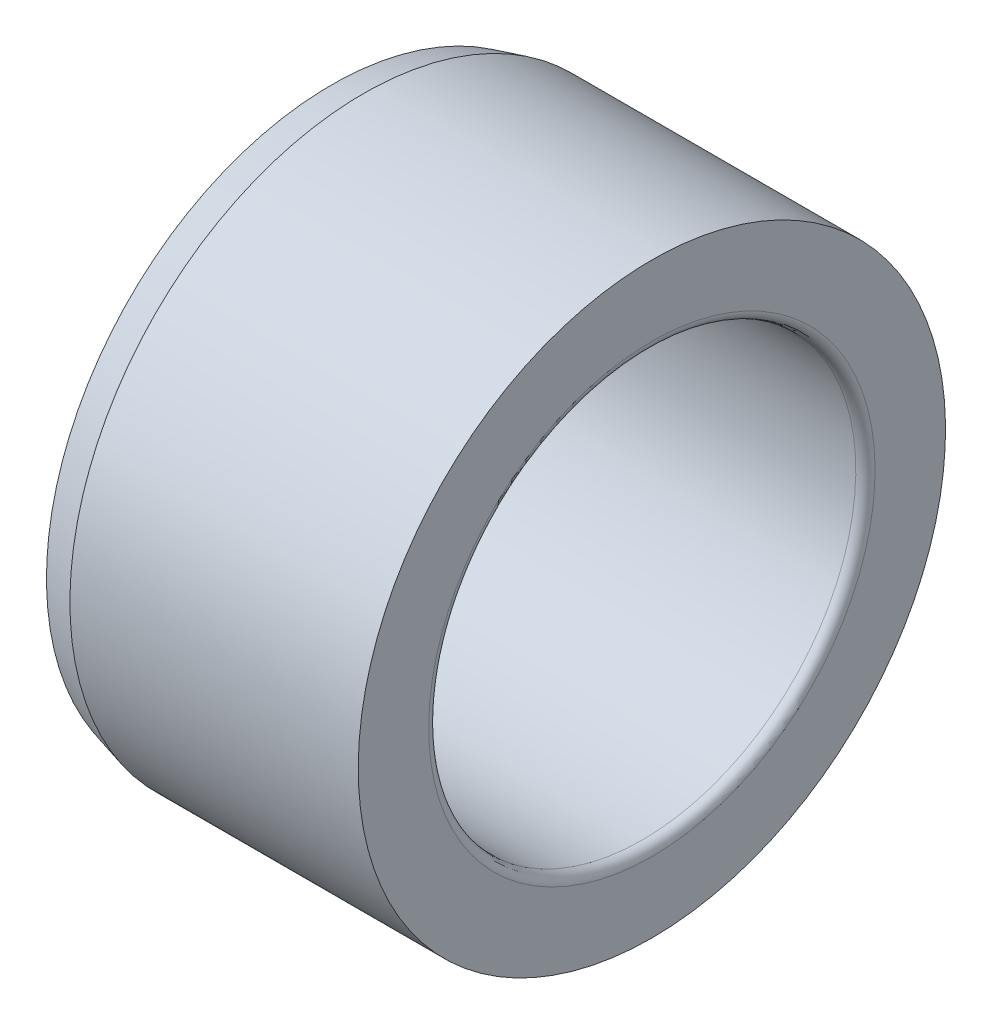
ISO-10303-21;
HEADER;
FILE_DESCRIPTION(('STEP AP214'),'2;1');
FILE_NAME('part.step','',(''),(''),'','','');
FILE_SCHEMA(('AUTOMOTIVE_DESIGN { 1 0 10303 214 1 1 1 1 }'));
ENDSEC;
DATA;
#1=APPLICATION_CONTEXT('core data for automotive mechanical design processes');
#2=APPLICATION_PROTOCOL_DEFINITION('international standard','automotive_design',2000,#1);
#3=PRODUCT_CONTEXT('',#1,'mechanical');
#4=PRODUCT('Part','Part','',(#3));
#5=PRODUCT_RELATED_PRODUCT_CATEGORY('part','',(#4));
#6=PRODUCT_DEFINITION_FORMATION('','',#4);
#7=PRODUCT_DEFINITION_CONTEXT('part definition',#1,'design');
#8=PRODUCT_DEFINITION('design','',#6,#7);
#9=PRODUCT_DEFINITION_SHAPE('','',#8);
#10=(LENGTH_UNIT() NAMED_UNIT(*) SI_UNIT(.MILLI.,.METRE.));
#11=(NAMED_UNIT(*) PLANE_ANGLE_UNIT() SI_UNIT($,.RADIAN.));
#12=(NAMED_UNIT(*) SI_UNIT($,.STERADIAN.) SOLID_ANGLE_UNIT());
#13=UNCERTAINTY_MEASURE_WITH_UNIT(LENGTH_MEASURE(1.E-05),#10,'distance_accuracy_value','');
#14=(GEOMETRIC_REPRESENTATION_CONTEXT(3) GLOBAL_UNCERTAINTY_ASSIGNED_CONTEXT((#13)) GLOBAL_UNIT_ASSIGNED_CONTEXT((#10,
#11,#12)) REPRESENTATION_CONTEXT('',''));
#15=CARTESIAN_POINT('',(0.,0.,0.));
#16=DIRECTION('',(0.,0.,1.));
#17=DIRECTION('',(1.,0.,0.));
#18=AXIS2_PLACEMENT_3D('',#15,#16,#17);
#19=CARTESIAN_POINT('',(8.9535,0.,0.));
#20=DIRECTION('',(-1.,0.,0.));
#21=DIRECTION('',(0.,-1.,0.));
#22=AXIS2_PLACEMENT_3D('',#19,#20,#21);
#23=TOROIDAL_SURFACE('',#22,13.2715,0.571499999999998);
#24=CARTESIAN_POINT('',(9.52500000000001,0.,0.));
#25=DIRECTION('',(-1.,0.,0.));
#26=DIRECTION('',(0.,-1.,0.));
#27=AXIS2_PLACEMENT_3D('',#24,#25,#26);
#28=CIRCLE('',#27,13.2715);
#29=CARTESIAN_POINT('',(9.52500000000001,-13.2715,0.));
#30=VERTEX_POINT('',#29);
#31=EDGE_CURVE('E10',#30,#30,#28,.T.);
#32=ORIENTED_EDGE('',*,*,#31,.F.);
#33=EDGE_LOOP('',(#32));
#34=FACE_BOUND('',#33,.T.);
#35=CARTESIAN_POINT('',(8.9535,0.,0.));
#36=DIRECTION('',(-1.,0.,0.));
#37=DIRECTION('',(0.,-1.,0.));
#38=AXIS2_PLACEMENT_3D('',#35,#36,#37);
#39=CIRCLE('',#38,12.7);
#40=CARTESIAN_POINT('',(8.95350000000001,-12.7,0.));
#41=VERTEX_POINT('',#40);
#42=EDGE_CURVE('E55',#41,#41,#39,.T.);
#43=ORIENTED_EDGE('',*,*,#42,.T.);
#44=EDGE_LOOP('',(#43));
#45=FACE_BOUND('',#44,.T.);
#46=ADVANCED_FACE('F33',(#34,#45),#23,.T.);
#47=CARTESIAN_POINT('',(9.52500000000001,17.4625,0.));
#48=DIRECTION('',(-1.,0.,0.));
#49=DIRECTION('',(0.,-1.,0.));
#50=AXIS2_PLACEMENT_3D('',#47,#48,#49);
#51=PLANE('',#50);
#52=CARTESIAN_POINT('',(9.52500000000001,0.,0.));
#53=DIRECTION('',(-1.,0.,0.));
#54=DIRECTION('',(0.,-1.,0.));
#55=AXIS2_PLACEMENT_3D('',#52,#53,#54);
#56=CIRCLE('',#55,17.4625);
#57=CARTESIAN_POINT('',(9.52500000000001,-17.4625,0.));
#58=VERTEX_POINT('',#57);
#59=EDGE_CURVE('E39',#58,#58,#56,.T.);
#60=ORIENTED_EDGE('',*,*,#59,.F.);
#61=EDGE_LOOP('',(#60));
#62=FACE_BOUND('',#61,.T.);
#63=ORIENTED_EDGE('',*,*,#31,.T.);
#64=EDGE_LOOP('',(#63));
#65=FACE_BOUND('',#64,.T.);
#66=ADVANCED_FACE('F80',(#62,#65),#51,.F.);
#67=CARTESIAN_POINT('',(-9.52500000000001,0.,0.));
#68=DIRECTION('',(-1.,0.,0.));
#69=DIRECTION('',(0.,-1.,0.));
#70=AXIS2_PLACEMENT_3D('',#67,#68,#69);
#71=CYLINDRICAL_SURFACE('',#70,17.4625);
#72=CARTESIAN_POINT('',(-7.62000000000002,0.,0.));
#73=DIRECTION('',(-1.,0.,0.));
#74=DIRECTION('',(0.,-1.,0.));
#75=AXIS2_PLACEMENT_3D('',#72,#73,#74);
#76=CIRCLE('',#75,17.4625);
#77=CARTESIAN_POINT('',(-7.62000000000001,-17.4625,0.));
#78=VERTEX_POINT('',#77);
#79=EDGE_CURVE('E43',#78,#78,#76,.T.);
#80=ORIENTED_EDGE('',*,*,#79,.F.);
#81=EDGE_LOOP('',(#80));
#82=FACE_BOUND('',#81,.T.);
#83=ORIENTED_EDGE('',*,*,#59,.T.);
#84=EDGE_LOOP('',(#83));
#85=FACE_BOUND('',#84,.T.);
#86=ADVANCED_FACE('F75',(#82,#85),#71,.T.);
#87=CARTESIAN_POINT('',(-7.62000000000002,0.,0.));
#88=DIRECTION('',(1.,0.,0.));
#89=DIRECTION('',(0.,1.,0.));
#90=AXIS2_PLACEMENT_3D('',#87,#88,#89);
#91=CONICAL_SURFACE('',#90,17.4625,0.261799387799152);
#92=CARTESIAN_POINT('',(-9.52500000000001,0.,0.));
#93=DIRECTION('',(-1.,0.,0.));
#94=DIRECTION('',(0.,-1.,0.));
#95=AXIS2_PLACEMENT_3D('',#92,#93,#94);
#96=CIRCLE('',#95,16.9520567884187);
#97=CARTESIAN_POINT('',(-9.525,-16.9520567884187,0.));
#98=VERTEX_POINT('',#97);
#99=EDGE_CURVE('E47',#98,#98,#96,.T.);
#100=ORIENTED_EDGE('',*,*,#99,.F.);
#101=EDGE_LOOP('',(#100));
#102=FACE_BOUND('',#101,.T.);
#103=ORIENTED_EDGE('',*,*,#79,.T.);
#104=EDGE_LOOP('',(#103));
#105=FACE_BOUND('',#104,.T.);
#106=ADVANCED_FACE('F69',(#102,#105),#91,.T.);
#107=CARTESIAN_POINT('',(-9.52500000000001,16.9520567884187,0.));
#108=DIRECTION('',(1.,0.,0.));
#109=DIRECTION('',(0.,1.,0.));
#110=AXIS2_PLACEMENT_3D('',#107,#108,#109);
#111=PLANE('',#110);
#112=CARTESIAN_POINT('',(-9.52500000000001,0.,0.));
#113=DIRECTION('',(-1.,0.,0.));
#114=DIRECTION('',(0.,-1.,0.));
#115=AXIS2_PLACEMENT_3D('',#112,#113,#114);
#116=CIRCLE('',#115,12.7);
#117=CARTESIAN_POINT('',(-9.525,-12.7,0.));
#118=VERTEX_POINT('',#117);
#119=EDGE_CURVE('E52',#118,#118,#116,.T.);
#120=ORIENTED_EDGE('',*,*,#119,.F.);
#121=EDGE_LOOP('',(#120));
#122=FACE_BOUND('',#121,.T.);
#123=ORIENTED_EDGE('',*,*,#99,.T.);
#124=EDGE_LOOP('',(#123));
#125=FACE_BOUND('',#124,.T.);
#126=ADVANCED_FACE('F63',(#122,#125),#111,.F.);
#127=CARTESIAN_POINT('',(-9.52500000000001,0.,0.));
#128=DIRECTION('',(-1.,0.,0.));
#129=DIRECTION('',(0.,-1.,0.));
#130=AXIS2_PLACEMENT_3D('',#127,#128,#129);
#131=CYLINDRICAL_SURFACE('',#130,12.7);
#132=ORIENTED_EDGE('',*,*,#42,.F.);
#133=EDGE_LOOP('',(#132));
#134=FACE_BOUND('',#133,.T.);
#135=ORIENTED_EDGE('',*,*,#119,.T.);
#136=EDGE_LOOP('',(#135));
#137=FACE_BOUND('',#136,.T.);
#138=ADVANCED_FACE('F60',(#134,#137),#131,.F.);
#139=CLOSED_SHELL('',(#46,#66,#86,#106,#126,#138));
#140=MANIFOLD_SOLID_BREP('B2',#139);
#141=ADVANCED_BREP_SHAPE_REPRESENTATION('',(#18,#140),#14);
#142=SHAPE_DEFINITION_REPRESENTATION(#9,#141);
ENDSEC;
END-ISO-10303-21;
